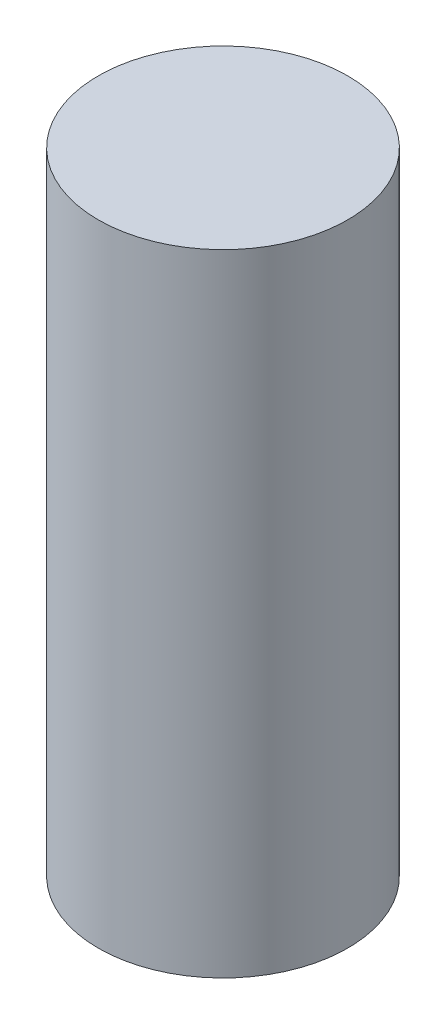
ISO-10303-21;
HEADER;
FILE_DESCRIPTION(('STEP AP214'),'2;1');
FILE_NAME('part.step','',(''),(''),'','','');
FILE_SCHEMA(('AUTOMOTIVE_DESIGN { 1 0 10303 214 1 1 1 1 }'));
ENDSEC;
DATA;
#1=APPLICATION_CONTEXT('core data for automotive mechanical design processes');
#2=APPLICATION_PROTOCOL_DEFINITION('international standard','automotive_design',2000,#1);
#3=PRODUCT_CONTEXT('',#1,'mechanical');
#4=PRODUCT('Part','Part','',(#3));
#5=PRODUCT_RELATED_PRODUCT_CATEGORY('part','',(#4));
#6=PRODUCT_DEFINITION_FORMATION('','',#4);
#7=PRODUCT_DEFINITION_CONTEXT('part definition',#1,'design');
#8=PRODUCT_DEFINITION('design','',#6,#7);
#9=PRODUCT_DEFINITION_SHAPE('','',#8);
#10=(LENGTH_UNIT() NAMED_UNIT(*) SI_UNIT(.MILLI.,.METRE.));
#11=(NAMED_UNIT(*) PLANE_ANGLE_UNIT() SI_UNIT($,.RADIAN.));
#12=(NAMED_UNIT(*) SI_UNIT($,.STERADIAN.) SOLID_ANGLE_UNIT());
#13=UNCERTAINTY_MEASURE_WITH_UNIT(LENGTH_MEASURE(1.E-05),#10,'distance_accuracy_value','');
#14=(GEOMETRIC_REPRESENTATION_CONTEXT(3) GLOBAL_UNCERTAINTY_ASSIGNED_CONTEXT((#13)) GLOBAL_UNIT_ASSIGNED_CONTEXT((#10,
#11,#12)) REPRESENTATION_CONTEXT('',''));
#15=CARTESIAN_POINT('',(0.,0.,0.));
#16=DIRECTION('',(0.,0.,1.));
#17=DIRECTION('',(1.,0.,0.));
#18=AXIS2_PLACEMENT_3D('',#15,#16,#17);
#19=CARTESIAN_POINT('',(0.,84.1248,0.));
#20=DIRECTION('',(0.,-1.,0.));
#21=DIRECTION('',(0.,0.,-1.));
#22=AXIS2_PLACEMENT_3D('',#19,#20,#21);
#23=CYLINDRICAL_SURFACE('',#22,16.637);
#24=CARTESIAN_POINT('',(0.,84.1248,0.));
#25=DIRECTION('',(0.,1.,0.));
#26=DIRECTION('',(0.,0.,1.));
#27=AXIS2_PLACEMENT_3D('',#24,#25,#26);
#28=CIRCLE('',#27,16.637);
#29=CARTESIAN_POINT('',(0.,84.1248,16.637));
#30=VERTEX_POINT('',#29);
#31=EDGE_CURVE('E10',#30,#30,#28,.T.);
#32=ORIENTED_EDGE('',*,*,#31,.F.);
#33=EDGE_LOOP('',(#32));
#34=FACE_BOUND('',#33,.T.);
#35=CARTESIAN_POINT('',(0.,0.,0.));
#36=DIRECTION('',(0.,1.,0.));
#37=DIRECTION('',(0.,0.,1.));
#38=AXIS2_PLACEMENT_3D('',#35,#36,#37);
#39=CIRCLE('',#38,16.637);
#40=CARTESIAN_POINT('',(0.,0.,16.637));
#41=VERTEX_POINT('',#40);
#42=EDGE_CURVE('E33',#41,#41,#39,.T.);
#43=ORIENTED_EDGE('',*,*,#42,.T.);
#44=EDGE_LOOP('',(#43));
#45=FACE_BOUND('',#44,.T.);
#46=ADVANCED_FACE('F30',(#34,#45),#23,.T.);
#47=CARTESIAN_POINT('',(0.,84.1248,0.));
#48=DIRECTION('',(0.,1.,0.));
#49=DIRECTION('',(0.,0.,1.));
#50=AXIS2_PLACEMENT_3D('',#47,#48,#49);
#51=PLANE('',#50);
#52=ORIENTED_EDGE('',*,*,#31,.T.);
#53=EDGE_LOOP('',(#52));
#54=FACE_BOUND('',#53,.T.);
#55=ADVANCED_FACE('F45',(#54),#51,.T.);
#56=CARTESIAN_POINT('',(0.,0.,0.));
#57=DIRECTION('',(0.,1.,0.));
#58=DIRECTION('',(0.,0.,1.));
#59=AXIS2_PLACEMENT_3D('',#56,#57,#58);
#60=PLANE('',#59);
#61=ORIENTED_EDGE('',*,*,#42,.F.);
#62=EDGE_LOOP('',(#61));
#63=FACE_BOUND('',#62,.T.);
#64=ADVANCED_FACE('F43',(#63),#60,.F.);
#65=CLOSED_SHELL('',(#46,#55,#64));
#66=MANIFOLD_SOLID_BREP('B2',#65);
#67=ADVANCED_BREP_SHAPE_REPRESENTATION('',(#18,#66),#14);
#68=SHAPE_DEFINITION_REPRESENTATION(#9,#67);
ENDSEC;
END-ISO-10303-21;
